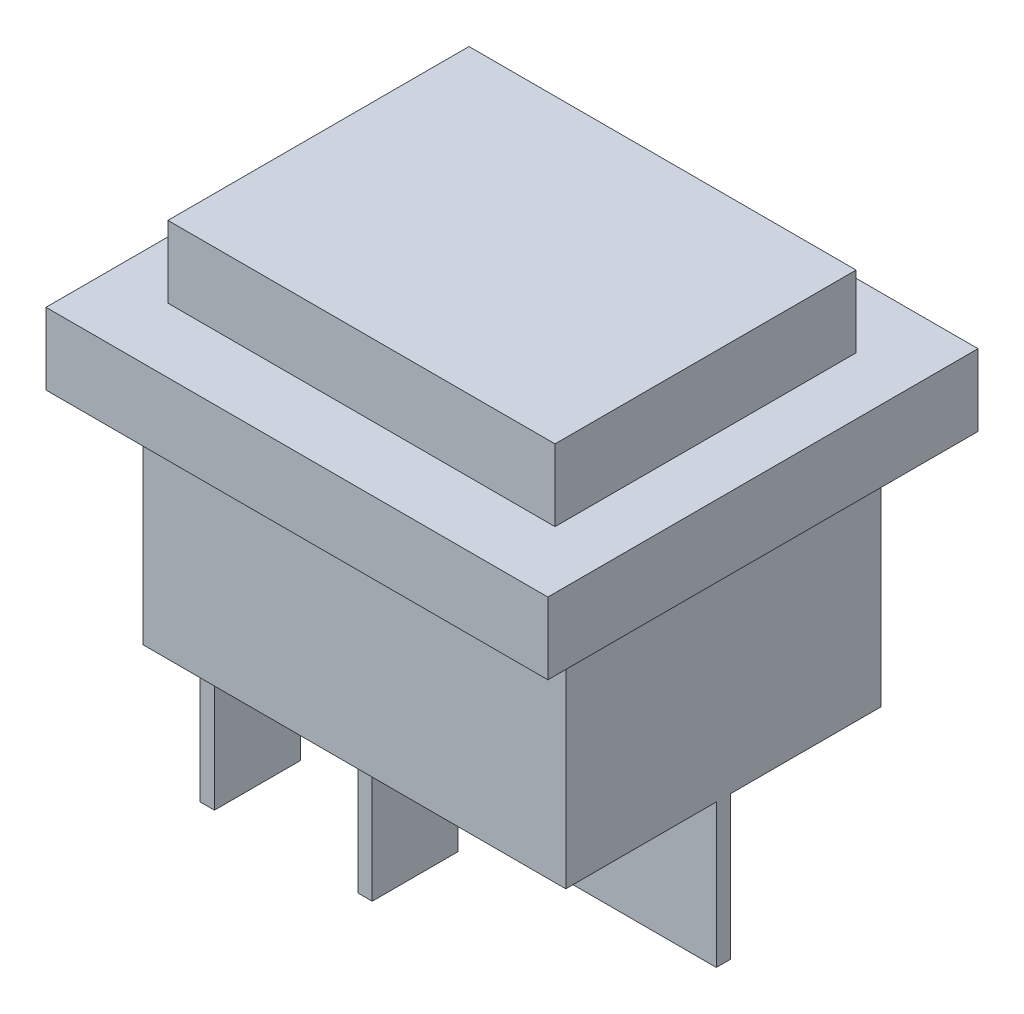
ISO-10303-21;
HEADER;
FILE_DESCRIPTION(('STEP AP214'),'2;1');
FILE_NAME('part.step','',(''),(''),'','','');
FILE_SCHEMA(('AUTOMOTIVE_DESIGN { 1 0 10303 214 1 1 1 1 }'));
ENDSEC;
DATA;
#1=APPLICATION_CONTEXT('core data for automotive mechanical design processes');
#2=APPLICATION_PROTOCOL_DEFINITION('international standard','automotive_design',2000,#1);
#3=PRODUCT_CONTEXT('',#1,'mechanical');
#4=PRODUCT('Part','Part','',(#3));
#5=PRODUCT_RELATED_PRODUCT_CATEGORY('part','',(#4));
#6=PRODUCT_DEFINITION_FORMATION('','',#4);
#7=PRODUCT_DEFINITION_CONTEXT('part definition',#1,'design');
#8=PRODUCT_DEFINITION('design','',#6,#7);
#9=PRODUCT_DEFINITION_SHAPE('','',#8);
#10=(LENGTH_UNIT() NAMED_UNIT(*) SI_UNIT(.MILLI.,.METRE.));
#11=(NAMED_UNIT(*) PLANE_ANGLE_UNIT() SI_UNIT($,.RADIAN.));
#12=(NAMED_UNIT(*) SI_UNIT($,.STERADIAN.) SOLID_ANGLE_UNIT());
#13=UNCERTAINTY_MEASURE_WITH_UNIT(LENGTH_MEASURE(1.E-05),#10,'distance_accuracy_value','');
#14=(GEOMETRIC_REPRESENTATION_CONTEXT(3) GLOBAL_UNCERTAINTY_ASSIGNED_CONTEXT((#13)) GLOBAL_UNIT_ASSIGNED_CONTEXT((#10,
#11,#12)) REPRESENTATION_CONTEXT('',''));
#15=CARTESIAN_POINT('',(0.,0.,0.));
#16=DIRECTION('',(0.,0.,1.));
#17=DIRECTION('',(1.,0.,0.));
#18=AXIS2_PLACEMENT_3D('',#15,#16,#17);
#19=CARTESIAN_POINT('',(0.,-16.,0.));
#20=DIRECTION('',(0.,1.,0.));
#21=DIRECTION('',(0.,0.,1.));
#22=AXIS2_PLACEMENT_3D('',#19,#20,#21);
#23=PLANE('',#22);
#24=DIRECTION('',(0.,0.,1.));
#25=VECTOR('',#24,1.);
#26=CARTESIAN_POINT('',(-12.25,-16.,-2.5));
#27=LINE('',#26,#25);
#28=CARTESIAN_POINT('',(-12.25,-16.,-8.5));
#29=VERTEX_POINT('',#28);
#30=CARTESIAN_POINT('',(-12.25,-16.,-2.5));
#31=VERTEX_POINT('',#30);
#32=EDGE_CURVE('E275',#29,#31,#27,.T.);
#33=ORIENTED_EDGE('',*,*,#32,.F.);
#34=DIRECTION('',(1.,0.,0.));
#35=VECTOR('',#34,1.);
#36=CARTESIAN_POINT('',(-13.25,-16.,-8.5));
#37=LINE('',#36,#35);
#38=CARTESIAN_POINT('',(-13.25,-16.,-8.5));
#39=VERTEX_POINT('',#38);
#40=EDGE_CURVE('E291',#39,#29,#37,.T.);
#41=ORIENTED_EDGE('',*,*,#40,.F.);
#42=DIRECTION('',(0.,0.,-1.));
#43=VECTOR('',#42,1.);
#44=CARTESIAN_POINT('',(-13.25,-16.,-2.5));
#45=LINE('',#44,#43);
#46=CARTESIAN_POINT('',(-13.25,-16.,-2.5));
#47=VERTEX_POINT('',#46);
#48=EDGE_CURVE('E304',#47,#39,#45,.T.);
#49=ORIENTED_EDGE('',*,*,#48,.F.);
#50=DIRECTION('',(-1.,0.,0.));
#51=VECTOR('',#50,1.);
#52=CARTESIAN_POINT('',(-13.25,-16.,-2.5));
#53=LINE('',#52,#51);
#54=EDGE_CURVE('E280',#31,#47,#53,.T.);
#55=ORIENTED_EDGE('',*,*,#54,.F.);
#56=EDGE_LOOP('',(#33,#41,#49,#55));
#57=FACE_BOUND('',#56,.T.);
#58=DIRECTION('',(1.,0.,0.));
#59=VECTOR('',#58,1.);
#60=CARTESIAN_POINT('',(-14.75,-16.,-0.5));
#61=LINE('',#60,#59);
#62=CARTESIAN_POINT('',(-14.75,-16.,-0.5));
#63=VERTEX_POINT('',#62);
#64=CARTESIAN_POINT('',(14.75,-16.,-0.5));
#65=VERTEX_POINT('',#64);
#66=EDGE_CURVE('E422',#63,#65,#61,.T.);
#67=ORIENTED_EDGE('',*,*,#66,.F.);
#68=DIRECTION('',(0.,0.,1.));
#69=VECTOR('',#68,1.);
#70=CARTESIAN_POINT('',(-14.75,-16.,-11.));
#71=LINE('',#70,#69);
#72=CARTESIAN_POINT('',(-14.75,-16.,-11.));
#73=VERTEX_POINT('',#72);
#74=EDGE_CURVE('E551',#73,#63,#71,.T.);
#75=ORIENTED_EDGE('',*,*,#74,.F.);
#76=DIRECTION('',(-1.,0.,0.));
#77=VECTOR('',#76,1.);
#78=CARTESIAN_POINT('',(-14.75,-16.,-11.));
#79=LINE('',#78,#77);
#80=CARTESIAN_POINT('',(14.75,-16.,-11.));
#81=VERTEX_POINT('',#80);
#82=EDGE_CURVE('E545',#81,#73,#79,.T.);
#83=ORIENTED_EDGE('',*,*,#82,.F.);
#84=DIRECTION('',(0.,0.,-1.));
#85=VECTOR('',#84,1.);
#86=CARTESIAN_POINT('',(14.75,-16.,-11.));
#87=LINE('',#86,#85);
#88=EDGE_CURVE('E546',#65,#81,#87,.T.);
#89=ORIENTED_EDGE('',*,*,#88,.F.);
#90=EDGE_LOOP('',(#67,#75,#83,#89));
#91=FACE_BOUND('',#90,.T.);
#92=DIRECTION('',(0.,0.,1.));
#93=VECTOR('',#92,1.);
#94=CARTESIAN_POINT('',(-1.25,-16.,-2.5));
#95=LINE('',#94,#93);
#96=CARTESIAN_POINT('',(-1.25,-16.,-8.5));
#97=VERTEX_POINT('',#96);
#98=CARTESIAN_POINT('',(-1.25,-16.,-2.5));
#99=VERTEX_POINT('',#98);
#100=EDGE_CURVE('E273',#97,#99,#95,.T.);
#101=ORIENTED_EDGE('',*,*,#100,.F.);
#102=DIRECTION('',(1.,0.,0.));
#103=VECTOR('',#102,1.);
#104=CARTESIAN_POINT('',(-2.25,-16.,-8.5));
#105=LINE('',#104,#103);
#106=CARTESIAN_POINT('',(-2.25,-16.,-8.5));
#107=VERTEX_POINT('',#106);
#108=EDGE_CURVE('E270',#107,#97,#105,.T.);
#109=ORIENTED_EDGE('',*,*,#108,.F.);
#110=DIRECTION('',(0.,0.,-1.));
#111=VECTOR('',#110,1.);
#112=CARTESIAN_POINT('',(-2.25,-16.,-2.5));
#113=LINE('',#112,#111);
#114=CARTESIAN_POINT('',(-2.25,-16.,-2.5));
#115=VERTEX_POINT('',#114);
#116=EDGE_CURVE('E62',#115,#107,#113,.T.);
#117=ORIENTED_EDGE('',*,*,#116,.F.);
#118=DIRECTION('',(-1.,0.,0.));
#119=VECTOR('',#118,1.);
#120=CARTESIAN_POINT('',(-2.25,-16.,-2.5));
#121=LINE('',#120,#119);
#122=EDGE_CURVE('E57',#99,#115,#121,.T.);
#123=ORIENTED_EDGE('',*,*,#122,.F.);
#124=EDGE_LOOP('',(#101,#109,#117,#123));
#125=FACE_BOUND('',#124,.T.);
#126=ADVANCED_FACE('F39',(#57,#91,#125),#23,.F.);
#127=DIRECTION('',(0.,0.,1.));
#128=VECTOR('',#127,1.);
#129=CARTESIAN_POINT('',(-12.25,-16.,8.5));
#130=LINE('',#129,#128);
#131=CARTESIAN_POINT('',(-12.25,-16.,2.5));
#132=VERTEX_POINT('',#131);
#133=CARTESIAN_POINT('',(-12.25,-16.,8.5));
#134=VERTEX_POINT('',#133);
#135=EDGE_CURVE('E371',#132,#134,#130,.T.);
#136=ORIENTED_EDGE('',*,*,#135,.F.);
#137=DIRECTION('',(1.,0.,0.));
#138=VECTOR('',#137,1.);
#139=CARTESIAN_POINT('',(-13.25,-16.,2.5));
#140=LINE('',#139,#138);
#141=CARTESIAN_POINT('',(-13.25,-16.,2.5));
#142=VERTEX_POINT('',#141);
#143=EDGE_CURVE('E377',#142,#132,#140,.T.);
#144=ORIENTED_EDGE('',*,*,#143,.F.);
#145=DIRECTION('',(0.,0.,-1.));
#146=VECTOR('',#145,1.);
#147=CARTESIAN_POINT('',(-13.25,-16.,8.5));
#148=LINE('',#147,#146);
#149=CARTESIAN_POINT('',(-13.25,-16.,8.5));
#150=VERTEX_POINT('',#149);
#151=EDGE_CURVE('E394',#150,#142,#148,.T.);
#152=ORIENTED_EDGE('',*,*,#151,.F.);
#153=DIRECTION('',(-1.,0.,0.));
#154=VECTOR('',#153,1.);
#155=CARTESIAN_POINT('',(-13.25,-16.,8.5));
#156=LINE('',#155,#154);
#157=EDGE_CURVE('E390',#134,#150,#156,.T.);
#158=ORIENTED_EDGE('',*,*,#157,.F.);
#159=EDGE_LOOP('',(#136,#144,#152,#158));
#160=FACE_BOUND('',#159,.T.);
#161=DIRECTION('',(-1.,0.,0.));
#162=VECTOR('',#161,1.);
#163=CARTESIAN_POINT('',(-14.75,-16.,0.5));
#164=LINE('',#163,#162);
#165=CARTESIAN_POINT('',(14.75,-16.,0.5));
#166=VERTEX_POINT('',#165);
#167=CARTESIAN_POINT('',(-14.75,-16.,0.5));
#168=VERTEX_POINT('',#167);
#169=EDGE_CURVE('E416',#166,#168,#164,.T.);
#170=ORIENTED_EDGE('',*,*,#169,.F.);
#171=CARTESIAN_POINT('',(14.75,-16.,11.));
#172=VERTEX_POINT('',#171);
#173=EDGE_CURVE('E541',#172,#166,#87,.T.);
#174=ORIENTED_EDGE('',*,*,#173,.F.);
#175=DIRECTION('',(1.,0.,0.));
#176=VECTOR('',#175,1.);
#177=CARTESIAN_POINT('',(-14.75,-16.,11.));
#178=LINE('',#177,#176);
#179=CARTESIAN_POINT('',(-14.75,-16.,11.));
#180=VERTEX_POINT('',#179);
#181=EDGE_CURVE('E555',#180,#172,#178,.T.);
#182=ORIENTED_EDGE('',*,*,#181,.F.);
#183=EDGE_CURVE('E550',#168,#180,#71,.T.);
#184=ORIENTED_EDGE('',*,*,#183,.F.);
#185=EDGE_LOOP('',(#170,#174,#182,#184));
#186=FACE_BOUND('',#185,.T.);
#187=DIRECTION('',(0.,0.,1.));
#188=VECTOR('',#187,1.);
#189=CARTESIAN_POINT('',(-1.25,-16.,8.5));
#190=LINE('',#189,#188);
#191=CARTESIAN_POINT('',(-1.25,-16.,2.5));
#192=VERTEX_POINT('',#191);
#193=CARTESIAN_POINT('',(-1.25,-16.,8.5));
#194=VERTEX_POINT('',#193);
#195=EDGE_CURVE('E326',#192,#194,#190,.T.);
#196=ORIENTED_EDGE('',*,*,#195,.F.);
#197=DIRECTION('',(1.,0.,0.));
#198=VECTOR('',#197,1.);
#199=CARTESIAN_POINT('',(-2.25,-16.,2.5));
#200=LINE('',#199,#198);
#201=CARTESIAN_POINT('',(-2.25,-16.,2.5));
#202=VERTEX_POINT('',#201);
#203=EDGE_CURVE('E332',#202,#192,#200,.T.);
#204=ORIENTED_EDGE('',*,*,#203,.F.);
#205=DIRECTION('',(0.,0.,-1.));
#206=VECTOR('',#205,1.);
#207=CARTESIAN_POINT('',(-2.25,-16.,8.5));
#208=LINE('',#207,#206);
#209=CARTESIAN_POINT('',(-2.25,-16.,8.5));
#210=VERTEX_POINT('',#209);
#211=EDGE_CURVE('E349',#210,#202,#208,.T.);
#212=ORIENTED_EDGE('',*,*,#211,.F.);
#213=DIRECTION('',(-1.,0.,0.));
#214=VECTOR('',#213,1.);
#215=CARTESIAN_POINT('',(-2.25,-16.,8.5));
#216=LINE('',#215,#214);
#217=EDGE_CURVE('E345',#194,#210,#216,.T.);
#218=ORIENTED_EDGE('',*,*,#217,.F.);
#219=EDGE_LOOP('',(#196,#204,#212,#218));
#220=FACE_BOUND('',#219,.T.);
#221=ADVANCED_FACE('F595',(#160,#186,#220),#23,.F.);
#222=CARTESIAN_POINT('',(14.75,-16.,-11.));
#223=DIRECTION('',(1.,0.,0.));
#224=DIRECTION('',(0.,0.,-1.));
#225=AXIS2_PLACEMENT_3D('',#222,#223,#224);
#226=PLANE('',#225);
#227=DIRECTION('',(0.,0.,-1.));
#228=VECTOR('',#227,1.);
#229=CARTESIAN_POINT('',(14.75,0.,-11.));
#230=LINE('',#229,#228);
#231=CARTESIAN_POINT('',(14.75,0.,11.));
#232=VERTEX_POINT('',#231);
#233=CARTESIAN_POINT('',(14.75,0.,-11.));
#234=VERTEX_POINT('',#233);
#235=EDGE_CURVE('E540',#232,#234,#230,.T.);
#236=ORIENTED_EDGE('',*,*,#235,.F.);
#237=DIRECTION('',(0.,1.,0.));
#238=VECTOR('',#237,1.);
#239=CARTESIAN_POINT('',(14.75,-16.,11.));
#240=LINE('',#239,#238);
#241=EDGE_CURVE('E11',#172,#232,#240,.T.);
#242=ORIENTED_EDGE('',*,*,#241,.F.);
#243=ORIENTED_EDGE('',*,*,#173,.T.);
#244=DIRECTION('',(0.,1.,0.));
#245=VECTOR('',#244,1.);
#246=CARTESIAN_POINT('',(14.75,-26.,0.5));
#247=LINE('',#246,#245);
#248=CARTESIAN_POINT('',(14.75,-26.,0.5));
#249=VERTEX_POINT('',#248);
#250=EDGE_CURVE('E449',#249,#166,#247,.T.);
#251=ORIENTED_EDGE('',*,*,#250,.F.);
#252=DIRECTION('',(0.,0.,1.));
#253=VECTOR('',#252,1.);
#254=CARTESIAN_POINT('',(14.75,-26.,0.5));
#255=LINE('',#254,#253);
#256=CARTESIAN_POINT('',(14.75,-26.,-0.5));
#257=VERTEX_POINT('',#256);
#258=EDGE_CURVE('E417',#257,#249,#255,.T.);
#259=ORIENTED_EDGE('',*,*,#258,.F.);
#260=DIRECTION('',(0.,1.,0.));
#261=VECTOR('',#260,1.);
#262=CARTESIAN_POINT('',(14.75,-26.,-0.5));
#263=LINE('',#262,#261);
#264=EDGE_CURVE('E431',#257,#65,#263,.T.);
#265=ORIENTED_EDGE('',*,*,#264,.T.);
#266=ORIENTED_EDGE('',*,*,#88,.T.);
#267=DIRECTION('',(0.,1.,0.));
#268=VECTOR('',#267,1.);
#269=CARTESIAN_POINT('',(14.75,-16.,-11.));
#270=LINE('',#269,#268);
#271=EDGE_CURVE('E43',#81,#234,#270,.T.);
#272=ORIENTED_EDGE('',*,*,#271,.T.);
#273=EDGE_LOOP('',(#236,#242,#243,#251,#259,#265,#266,#272));
#274=FACE_BOUND('',#273,.T.);
#275=ADVANCED_FACE('F41',(#274),#226,.T.);
#276=CARTESIAN_POINT('',(-14.75,-16.,11.));
#277=DIRECTION('',(0.,0.,1.));
#278=DIRECTION('',(1.,0.,0.));
#279=AXIS2_PLACEMENT_3D('',#276,#277,#278);
#280=PLANE('',#279);
#281=DIRECTION('',(1.,0.,0.));
#282=VECTOR('',#281,1.);
#283=CARTESIAN_POINT('',(-14.75,0.,11.));
#284=LINE('',#283,#282);
#285=CARTESIAN_POINT('',(-14.75,0.,11.));
#286=VERTEX_POINT('',#285);
#287=EDGE_CURVE('E570',#286,#232,#284,.T.);
#288=ORIENTED_EDGE('',*,*,#287,.F.);
#289=DIRECTION('',(0.,1.,0.));
#290=VECTOR('',#289,1.);
#291=CARTESIAN_POINT('',(-14.75,-16.,11.));
#292=LINE('',#291,#290);
#293=EDGE_CURVE('E49',#180,#286,#292,.T.);
#294=ORIENTED_EDGE('',*,*,#293,.F.);
#295=ORIENTED_EDGE('',*,*,#181,.T.);
#296=ORIENTED_EDGE('',*,*,#241,.T.);
#297=EDGE_LOOP('',(#288,#294,#295,#296));
#298=FACE_BOUND('',#297,.T.);
#299=ADVANCED_FACE('F590',(#298),#280,.T.);
#300=CARTESIAN_POINT('',(-14.75,-16.,-11.));
#301=DIRECTION('',(-1.,0.,0.));
#302=DIRECTION('',(0.,0.,1.));
#303=AXIS2_PLACEMENT_3D('',#300,#301,#302);
#304=PLANE('',#303);
#305=DIRECTION('',(0.,0.,1.));
#306=VECTOR('',#305,1.);
#307=CARTESIAN_POINT('',(-14.75,0.,-11.));
#308=LINE('',#307,#306);
#309=CARTESIAN_POINT('',(-14.75,0.,-11.));
#310=VERTEX_POINT('',#309);
#311=EDGE_CURVE('E566',#310,#286,#308,.T.);
#312=ORIENTED_EDGE('',*,*,#311,.F.);
#313=DIRECTION('',(0.,1.,0.));
#314=VECTOR('',#313,1.);
#315=CARTESIAN_POINT('',(-14.75,-16.,-11.));
#316=LINE('',#315,#314);
#317=EDGE_CURVE('E575',#73,#310,#316,.T.);
#318=ORIENTED_EDGE('',*,*,#317,.F.);
#319=ORIENTED_EDGE('',*,*,#74,.T.);
#320=DIRECTION('',(0.,1.,0.));
#321=VECTOR('',#320,1.);
#322=CARTESIAN_POINT('',(-14.75,-26.,-0.5));
#323=LINE('',#322,#321);
#324=CARTESIAN_POINT('',(-14.75,-26.,-0.5));
#325=VERTEX_POINT('',#324);
#326=EDGE_CURVE('E441',#325,#63,#323,.T.);
#327=ORIENTED_EDGE('',*,*,#326,.F.);
#328=DIRECTION('',(0.,0.,-1.));
#329=VECTOR('',#328,1.);
#330=CARTESIAN_POINT('',(-14.75,-26.,0.5));
#331=LINE('',#330,#329);
#332=CARTESIAN_POINT('',(-14.75,-26.,0.5));
#333=VERTEX_POINT('',#332);
#334=EDGE_CURVE('E425',#333,#325,#331,.T.);
#335=ORIENTED_EDGE('',*,*,#334,.F.);
#336=DIRECTION('',(0.,1.,0.));
#337=VECTOR('',#336,1.);
#338=CARTESIAN_POINT('',(-14.75,-26.,0.5));
#339=LINE('',#338,#337);
#340=EDGE_CURVE('E445',#333,#168,#339,.T.);
#341=ORIENTED_EDGE('',*,*,#340,.T.);
#342=ORIENTED_EDGE('',*,*,#183,.T.);
#343=ORIENTED_EDGE('',*,*,#293,.T.);
#344=EDGE_LOOP('',(#312,#318,#319,#327,#335,#341,#342,#343));
#345=FACE_BOUND('',#344,.T.);
#346=ADVANCED_FACE('F602',(#345),#304,.T.);
#347=CARTESIAN_POINT('',(-14.75,-16.,-11.));
#348=DIRECTION('',(0.,0.,-1.));
#349=DIRECTION('',(-1.,0.,0.));
#350=AXIS2_PLACEMENT_3D('',#347,#348,#349);
#351=PLANE('',#350);
#352=DIRECTION('',(-1.,0.,0.));
#353=VECTOR('',#352,1.);
#354=CARTESIAN_POINT('',(-14.75,0.,-11.));
#355=LINE('',#354,#353);
#356=EDGE_CURVE('E562',#234,#310,#355,.T.);
#357=ORIENTED_EDGE('',*,*,#356,.F.);
#358=ORIENTED_EDGE('',*,*,#271,.F.);
#359=ORIENTED_EDGE('',*,*,#82,.T.);
#360=ORIENTED_EDGE('',*,*,#317,.T.);
#361=EDGE_LOOP('',(#357,#358,#359,#360));
#362=FACE_BOUND('',#361,.T.);
#363=ADVANCED_FACE('F584',(#362),#351,.T.);
#364=CARTESIAN_POINT('',(0.,0.,0.));
#365=DIRECTION('',(0.,1.,0.));
#366=DIRECTION('',(0.,0.,1.));
#367=AXIS2_PLACEMENT_3D('',#364,#365,#366);
#368=PLANE('',#367);
#369=DIRECTION('',(0.,0.,-1.));
#370=VECTOR('',#369,1.);
#371=CARTESIAN_POINT('',(17.5,0.,-15.));
#372=LINE('',#371,#370);
#373=CARTESIAN_POINT('',(17.5,0.,15.));
#374=VERTEX_POINT('',#373);
#375=CARTESIAN_POINT('',(17.5,0.,-15.));
#376=VERTEX_POINT('',#375);
#377=EDGE_CURVE('E498',#374,#376,#372,.T.);
#378=ORIENTED_EDGE('',*,*,#377,.F.);
#379=DIRECTION('',(1.,0.,0.));
#380=VECTOR('',#379,1.);
#381=CARTESIAN_POINT('',(-17.5,0.,15.));
#382=LINE('',#381,#380);
#383=CARTESIAN_POINT('',(-17.5,0.,15.));
#384=VERTEX_POINT('',#383);
#385=EDGE_CURVE('E504',#384,#374,#382,.T.);
#386=ORIENTED_EDGE('',*,*,#385,.F.);
#387=DIRECTION('',(0.,0.,1.));
#388=VECTOR('',#387,1.);
#389=CARTESIAN_POINT('',(-17.5,0.,-15.));
#390=LINE('',#389,#388);
#391=CARTESIAN_POINT('',(-17.5,0.,-15.));
#392=VERTEX_POINT('',#391);
#393=EDGE_CURVE('E520',#392,#384,#390,.T.);
#394=ORIENTED_EDGE('',*,*,#393,.F.);
#395=DIRECTION('',(-1.,0.,0.));
#396=VECTOR('',#395,1.);
#397=CARTESIAN_POINT('',(-17.5,0.,-15.));
#398=LINE('',#397,#396);
#399=EDGE_CURVE('E517',#376,#392,#398,.T.);
#400=ORIENTED_EDGE('',*,*,#399,.F.);
#401=EDGE_LOOP('',(#378,#386,#394,#400));
#402=FACE_BOUND('',#401,.T.);
#403=ORIENTED_EDGE('',*,*,#287,.T.);
#404=ORIENTED_EDGE('',*,*,#235,.T.);
#405=ORIENTED_EDGE('',*,*,#356,.T.);
#406=ORIENTED_EDGE('',*,*,#311,.T.);
#407=EDGE_LOOP('',(#403,#404,#405,#406));
#408=FACE_BOUND('',#407,.T.);
#409=ADVANCED_FACE('F586',(#402,#408),#368,.F.);
#410=CARTESIAN_POINT('',(17.5,5.,-15.));
#411=DIRECTION('',(-1.,0.,0.));
#412=DIRECTION('',(0.,0.,1.));
#413=AXIS2_PLACEMENT_3D('',#410,#411,#412);
#414=PLANE('',#413);
#415=ORIENTED_EDGE('',*,*,#377,.T.);
#416=DIRECTION('',(0.,-1.,0.));
#417=VECTOR('',#416,1.);
#418=CARTESIAN_POINT('',(17.5,5.,-15.));
#419=LINE('',#418,#417);
#420=CARTESIAN_POINT('',(17.5,5.,-15.));
#421=VERTEX_POINT('',#420);
#422=EDGE_CURVE('E536',#421,#376,#419,.T.);
#423=ORIENTED_EDGE('',*,*,#422,.F.);
#424=DIRECTION('',(0.,0.,-1.));
#425=VECTOR('',#424,1.);
#426=CARTESIAN_POINT('',(17.5,5.,-15.));
#427=LINE('',#426,#425);
#428=CARTESIAN_POINT('',(17.5,5.,15.));
#429=VERTEX_POINT('',#428);
#430=EDGE_CURVE('E499',#429,#421,#427,.T.);
#431=ORIENTED_EDGE('',*,*,#430,.F.);
#432=DIRECTION('',(0.,-1.,0.));
#433=VECTOR('',#432,1.);
#434=CARTESIAN_POINT('',(17.5,5.,15.));
#435=LINE('',#434,#433);
#436=EDGE_CURVE('E513',#429,#374,#435,.T.);
#437=ORIENTED_EDGE('',*,*,#436,.T.);
#438=EDGE_LOOP('',(#415,#423,#431,#437));
#439=FACE_BOUND('',#438,.T.);
#440=ADVANCED_FACE('F746',(#439),#414,.F.);
#441=CARTESIAN_POINT('',(-17.5,5.,-15.));
#442=DIRECTION('',(0.,0.,1.));
#443=DIRECTION('',(1.,0.,0.));
#444=AXIS2_PLACEMENT_3D('',#441,#442,#443);
#445=PLANE('',#444);
#446=ORIENTED_EDGE('',*,*,#399,.T.);
#447=DIRECTION('',(0.,-1.,0.));
#448=VECTOR('',#447,1.);
#449=CARTESIAN_POINT('',(-17.5,5.,-15.));
#450=LINE('',#449,#448);
#451=CARTESIAN_POINT('',(-17.5,5.,-15.));
#452=VERTEX_POINT('',#451);
#453=EDGE_CURVE('E532',#452,#392,#450,.T.);
#454=ORIENTED_EDGE('',*,*,#453,.F.);
#455=DIRECTION('',(-1.,0.,0.));
#456=VECTOR('',#455,1.);
#457=CARTESIAN_POINT('',(-17.5,5.,-15.));
#458=LINE('',#457,#456);
#459=EDGE_CURVE('E503',#421,#452,#458,.T.);
#460=ORIENTED_EDGE('',*,*,#459,.F.);
#461=ORIENTED_EDGE('',*,*,#422,.T.);
#462=EDGE_LOOP('',(#446,#454,#460,#461));
#463=FACE_BOUND('',#462,.T.);
#464=ADVANCED_FACE('F754',(#463),#445,.F.);
#465=CARTESIAN_POINT('',(-17.5,5.,-15.));
#466=DIRECTION('',(1.,0.,0.));
#467=DIRECTION('',(0.,0.,-1.));
#468=AXIS2_PLACEMENT_3D('',#465,#466,#467);
#469=PLANE('',#468);
#470=ORIENTED_EDGE('',*,*,#393,.T.);
#471=DIRECTION('',(0.,-1.,0.));
#472=VECTOR('',#471,1.);
#473=CARTESIAN_POINT('',(-17.5,5.,15.));
#474=LINE('',#473,#472);
#475=CARTESIAN_POINT('',(-17.5,5.,15.));
#476=VERTEX_POINT('',#475);
#477=EDGE_CURVE('E528',#476,#384,#474,.T.);
#478=ORIENTED_EDGE('',*,*,#477,.F.);
#479=DIRECTION('',(0.,0.,1.));
#480=VECTOR('',#479,1.);
#481=CARTESIAN_POINT('',(-17.5,5.,-15.));
#482=LINE('',#481,#480);
#483=EDGE_CURVE('E507',#452,#476,#482,.T.);
#484=ORIENTED_EDGE('',*,*,#483,.F.);
#485=ORIENTED_EDGE('',*,*,#453,.T.);
#486=EDGE_LOOP('',(#470,#478,#484,#485));
#487=FACE_BOUND('',#486,.T.);
#488=ADVANCED_FACE('F750',(#487),#469,.F.);
#489=CARTESIAN_POINT('',(-17.5,5.,15.));
#490=DIRECTION('',(0.,0.,-1.));
#491=DIRECTION('',(-1.,0.,0.));
#492=AXIS2_PLACEMENT_3D('',#489,#490,#491);
#493=PLANE('',#492);
#494=ORIENTED_EDGE('',*,*,#385,.T.);
#495=ORIENTED_EDGE('',*,*,#436,.F.);
#496=DIRECTION('',(1.,0.,0.));
#497=VECTOR('',#496,1.);
#498=CARTESIAN_POINT('',(-17.5,5.,15.));
#499=LINE('',#498,#497);
#500=EDGE_CURVE('E510',#476,#429,#499,.T.);
#501=ORIENTED_EDGE('',*,*,#500,.F.);
#502=ORIENTED_EDGE('',*,*,#477,.T.);
#503=EDGE_LOOP('',(#494,#495,#501,#502));
#504=FACE_BOUND('',#503,.T.);
#505=ADVANCED_FACE('F742',(#504),#493,.F.);
#506=CARTESIAN_POINT('',(0.,5.,0.));
#507=DIRECTION('',(0.,1.,0.));
#508=DIRECTION('',(0.,0.,1.));
#509=AXIS2_PLACEMENT_3D('',#506,#507,#508);
#510=PLANE('',#509);
#511=DIRECTION('',(0.,0.,-1.));
#512=VECTOR('',#511,1.);
#513=CARTESIAN_POINT('',(13.5,5.,-10.5));
#514=LINE('',#513,#512);
#515=CARTESIAN_POINT('',(13.5,5.,10.5));
#516=VERTEX_POINT('',#515);
#517=CARTESIAN_POINT('',(13.5,5.,-10.5));
#518=VERTEX_POINT('',#517);
#519=EDGE_CURVE('E453',#516,#518,#514,.T.);
#520=ORIENTED_EDGE('',*,*,#519,.F.);
#521=DIRECTION('',(1.,0.,0.));
#522=VECTOR('',#521,1.);
#523=CARTESIAN_POINT('',(-13.5,5.,10.5));
#524=LINE('',#523,#522);
#525=CARTESIAN_POINT('',(-13.5,5.,10.5));
#526=VERTEX_POINT('',#525);
#527=EDGE_CURVE('E459',#526,#516,#524,.T.);
#528=ORIENTED_EDGE('',*,*,#527,.F.);
#529=DIRECTION('',(0.,0.,1.));
#530=VECTOR('',#529,1.);
#531=CARTESIAN_POINT('',(-13.5,5.,-10.5));
#532=LINE('',#531,#530);
#533=CARTESIAN_POINT('',(-13.5,5.,-10.5));
#534=VERTEX_POINT('',#533);
#535=EDGE_CURVE('E476',#534,#526,#532,.T.);
#536=ORIENTED_EDGE('',*,*,#535,.F.);
#537=DIRECTION('',(-1.,0.,0.));
#538=VECTOR('',#537,1.);
#539=CARTESIAN_POINT('',(-13.5,5.,-10.5));
#540=LINE('',#539,#538);
#541=EDGE_CURVE('E472',#518,#534,#540,.T.);
#542=ORIENTED_EDGE('',*,*,#541,.F.);
#543=EDGE_LOOP('',(#520,#528,#536,#542));
#544=FACE_BOUND('',#543,.T.);
#545=ORIENTED_EDGE('',*,*,#430,.T.);
#546=ORIENTED_EDGE('',*,*,#459,.T.);
#547=ORIENTED_EDGE('',*,*,#483,.T.);
#548=ORIENTED_EDGE('',*,*,#500,.T.);
#549=EDGE_LOOP('',(#545,#546,#547,#548));
#550=FACE_BOUND('',#549,.T.);
#551=ADVANCED_FACE('F738',(#544,#550),#510,.T.);
#552=CARTESIAN_POINT('',(13.5,10.,-10.5));
#553=DIRECTION('',(-1.,0.,0.));
#554=DIRECTION('',(0.,0.,1.));
#555=AXIS2_PLACEMENT_3D('',#552,#553,#554);
#556=PLANE('',#555);
#557=ORIENTED_EDGE('',*,*,#519,.T.);
#558=DIRECTION('',(0.,-1.,0.));
#559=VECTOR('',#558,1.);
#560=CARTESIAN_POINT('',(13.5,10.,-10.5));
#561=LINE('',#560,#559);
#562=CARTESIAN_POINT('',(13.5,10.,-10.5));
#563=VERTEX_POINT('',#562);
#564=EDGE_CURVE('E494',#563,#518,#561,.T.);
#565=ORIENTED_EDGE('',*,*,#564,.F.);
#566=DIRECTION('',(0.,0.,-1.));
#567=VECTOR('',#566,1.);
#568=CARTESIAN_POINT('',(13.5,10.,-10.5));
#569=LINE('',#568,#567);
#570=CARTESIAN_POINT('',(13.5,10.,10.5));
#571=VERTEX_POINT('',#570);
#572=EDGE_CURVE('E454',#571,#563,#569,.T.);
#573=ORIENTED_EDGE('',*,*,#572,.F.);
#574=DIRECTION('',(0.,-1.,0.));
#575=VECTOR('',#574,1.);
#576=CARTESIAN_POINT('',(13.5,10.,10.5));
#577=LINE('',#576,#575);
#578=EDGE_CURVE('E468',#571,#516,#577,.T.);
#579=ORIENTED_EDGE('',*,*,#578,.T.);
#580=EDGE_LOOP('',(#557,#565,#573,#579));
#581=FACE_BOUND('',#580,.T.);
#582=ADVANCED_FACE('F734',(#581),#556,.F.);
#583=CARTESIAN_POINT('',(-13.5,10.,-10.5));
#584=DIRECTION('',(0.,0.,1.));
#585=DIRECTION('',(1.,0.,0.));
#586=AXIS2_PLACEMENT_3D('',#583,#584,#585);
#587=PLANE('',#586);
#588=ORIENTED_EDGE('',*,*,#541,.T.);
#589=DIRECTION('',(0.,-1.,0.));
#590=VECTOR('',#589,1.);
#591=CARTESIAN_POINT('',(-13.5,10.,-10.5));
#592=LINE('',#591,#590);
#593=CARTESIAN_POINT('',(-13.5,10.,-10.5));
#594=VERTEX_POINT('',#593);
#595=EDGE_CURVE('E490',#594,#534,#592,.T.);
#596=ORIENTED_EDGE('',*,*,#595,.F.);
#597=DIRECTION('',(-1.,0.,0.));
#598=VECTOR('',#597,1.);
#599=CARTESIAN_POINT('',(-13.5,10.,-10.5));
#600=LINE('',#599,#598);
#601=EDGE_CURVE('E458',#563,#594,#600,.T.);
#602=ORIENTED_EDGE('',*,*,#601,.F.);
#603=ORIENTED_EDGE('',*,*,#564,.T.);
#604=EDGE_LOOP('',(#588,#596,#602,#603));
#605=FACE_BOUND('',#604,.T.);
#606=ADVANCED_FACE('F730',(#605),#587,.F.);
#607=CARTESIAN_POINT('',(-13.5,10.,-10.5));
#608=DIRECTION('',(1.,0.,0.));
#609=DIRECTION('',(0.,0.,-1.));
#610=AXIS2_PLACEMENT_3D('',#607,#608,#609);
#611=PLANE('',#610);
#612=ORIENTED_EDGE('',*,*,#535,.T.);
#613=DIRECTION('',(0.,-1.,0.));
#614=VECTOR('',#613,1.);
#615=CARTESIAN_POINT('',(-13.5,10.,10.5));
#616=LINE('',#615,#614);
#617=CARTESIAN_POINT('',(-13.5,10.,10.5));
#618=VERTEX_POINT('',#617);
#619=EDGE_CURVE('E486',#618,#526,#616,.T.);
#620=ORIENTED_EDGE('',*,*,#619,.F.);
#621=DIRECTION('',(0.,0.,1.));
#622=VECTOR('',#621,1.);
#623=CARTESIAN_POINT('',(-13.5,10.,-10.5));
#624=LINE('',#623,#622);
#625=EDGE_CURVE('E462',#594,#618,#624,.T.);
#626=ORIENTED_EDGE('',*,*,#625,.F.);
#627=ORIENTED_EDGE('',*,*,#595,.T.);
#628=EDGE_LOOP('',(#612,#620,#626,#627));
#629=FACE_BOUND('',#628,.T.);
#630=ADVANCED_FACE('F726',(#629),#611,.F.);
#631=CARTESIAN_POINT('',(-13.5,10.,10.5));
#632=DIRECTION('',(0.,0.,-1.));
#633=DIRECTION('',(-1.,0.,0.));
#634=AXIS2_PLACEMENT_3D('',#631,#632,#633);
#635=PLANE('',#634);
#636=ORIENTED_EDGE('',*,*,#527,.T.);
#637=ORIENTED_EDGE('',*,*,#578,.F.);
#638=DIRECTION('',(1.,0.,0.));
#639=VECTOR('',#638,1.);
#640=CARTESIAN_POINT('',(-13.5,10.,10.5));
#641=LINE('',#640,#639);
#642=EDGE_CURVE('E465',#618,#571,#641,.T.);
#643=ORIENTED_EDGE('',*,*,#642,.F.);
#644=ORIENTED_EDGE('',*,*,#619,.T.);
#645=EDGE_LOOP('',(#636,#637,#643,#644));
#646=FACE_BOUND('',#645,.T.);
#647=ADVANCED_FACE('F722',(#646),#635,.F.);
#648=CARTESIAN_POINT('',(0.,10.,0.));
#649=DIRECTION('',(0.,1.,0.));
#650=DIRECTION('',(0.,0.,1.));
#651=AXIS2_PLACEMENT_3D('',#648,#649,#650);
#652=PLANE('',#651);
#653=ORIENTED_EDGE('',*,*,#572,.T.);
#654=ORIENTED_EDGE('',*,*,#601,.T.);
#655=ORIENTED_EDGE('',*,*,#625,.T.);
#656=ORIENTED_EDGE('',*,*,#642,.T.);
#657=EDGE_LOOP('',(#653,#654,#655,#656));
#658=FACE_BOUND('',#657,.T.);
#659=ADVANCED_FACE('F719',(#658),#652,.T.);
#660=CARTESIAN_POINT('',(-14.75,-26.,0.5));
#661=DIRECTION('',(0.,0.,-1.));
#662=DIRECTION('',(-1.,0.,0.));
#663=AXIS2_PLACEMENT_3D('',#660,#661,#662);
#664=PLANE('',#663);
#665=ORIENTED_EDGE('',*,*,#169,.T.);
#666=ORIENTED_EDGE('',*,*,#340,.F.);
#667=DIRECTION('',(-1.,0.,0.));
#668=VECTOR('',#667,1.);
#669=CARTESIAN_POINT('',(-14.75,-26.,0.5));
#670=LINE('',#669,#668);
#671=EDGE_CURVE('E421',#249,#333,#670,.T.);
#672=ORIENTED_EDGE('',*,*,#671,.F.);
#673=ORIENTED_EDGE('',*,*,#250,.T.);
#674=EDGE_LOOP('',(#665,#666,#672,#673));
#675=FACE_BOUND('',#674,.T.);
#676=ADVANCED_FACE('F599',(#675),#664,.F.);
#677=CARTESIAN_POINT('',(-14.75,-26.,-0.5));
#678=DIRECTION('',(0.,0.,1.));
#679=DIRECTION('',(1.,0.,0.));
#680=AXIS2_PLACEMENT_3D('',#677,#678,#679);
#681=PLANE('',#680);
#682=ORIENTED_EDGE('',*,*,#66,.T.);
#683=ORIENTED_EDGE('',*,*,#264,.F.);
#684=DIRECTION('',(1.,0.,0.));
#685=VECTOR('',#684,1.);
#686=CARTESIAN_POINT('',(-14.75,-26.,-0.5));
#687=LINE('',#686,#685);
#688=EDGE_CURVE('E428',#325,#257,#687,.T.);
#689=ORIENTED_EDGE('',*,*,#688,.F.);
#690=ORIENTED_EDGE('',*,*,#326,.T.);
#691=EDGE_LOOP('',(#682,#683,#689,#690));
#692=FACE_BOUND('',#691,.T.);
#693=ADVANCED_FACE('F610',(#692),#681,.F.);
#694=CARTESIAN_POINT('',(0.,-26.,0.));
#695=DIRECTION('',(0.,-1.,0.));
#696=DIRECTION('',(0.,0.,-1.));
#697=AXIS2_PLACEMENT_3D('',#694,#695,#696);
#698=PLANE('',#697);
#699=ORIENTED_EDGE('',*,*,#258,.T.);
#700=ORIENTED_EDGE('',*,*,#671,.T.);
#701=ORIENTED_EDGE('',*,*,#334,.T.);
#702=ORIENTED_EDGE('',*,*,#688,.T.);
#703=EDGE_LOOP('',(#699,#700,#701,#702));
#704=FACE_BOUND('',#703,.T.);
#705=ADVANCED_FACE('F606',(#704),#698,.T.);
#706=CARTESIAN_POINT('',(-12.25,-26.,8.5));
#707=DIRECTION('',(-1.,0.,0.));
#708=DIRECTION('',(0.,0.,1.));
#709=AXIS2_PLACEMENT_3D('',#706,#707,#708);
#710=PLANE('',#709);
#711=ORIENTED_EDGE('',*,*,#135,.T.);
#712=DIRECTION('',(0.,1.,0.));
#713=VECTOR('',#712,1.);
#714=CARTESIAN_POINT('',(-12.25,-26.,8.5));
#715=LINE('',#714,#713);
#716=CARTESIAN_POINT('',(-12.25,-26.,8.5));
#717=VERTEX_POINT('',#716);
#718=EDGE_CURVE('E412',#717,#134,#715,.T.);
#719=ORIENTED_EDGE('',*,*,#718,.F.);
#720=DIRECTION('',(0.,0.,1.));
#721=VECTOR('',#720,1.);
#722=CARTESIAN_POINT('',(-12.25,-26.,8.5));
#723=LINE('',#722,#721);
#724=CARTESIAN_POINT('',(-12.25,-26.,2.5));
#725=VERTEX_POINT('',#724);
#726=EDGE_CURVE('E372',#725,#717,#723,.T.);
#727=ORIENTED_EDGE('',*,*,#726,.F.);
#728=DIRECTION('',(0.,1.,0.));
#729=VECTOR('',#728,1.);
#730=CARTESIAN_POINT('',(-12.25,-26.,2.5));
#731=LINE('',#730,#729);
#732=EDGE_CURVE('E386',#725,#132,#731,.T.);
#733=ORIENTED_EDGE('',*,*,#732,.T.);
#734=EDGE_LOOP('',(#711,#719,#727,#733));
#735=FACE_BOUND('',#734,.T.);
#736=ADVANCED_FACE('F708',(#735),#710,.F.);
#737=CARTESIAN_POINT('',(-13.25,-26.,8.5));
#738=DIRECTION('',(0.,0.,-1.));
#739=DIRECTION('',(-1.,0.,0.));
#740=AXIS2_PLACEMENT_3D('',#737,#738,#739);
#741=PLANE('',#740);
#742=ORIENTED_EDGE('',*,*,#157,.T.);
#743=DIRECTION('',(0.,1.,0.));
#744=VECTOR('',#743,1.);
#745=CARTESIAN_POINT('',(-13.25,-26.,8.5));
#746=LINE('',#745,#744);
#747=CARTESIAN_POINT('',(-13.25,-26.,8.5));
#748=VERTEX_POINT('',#747);
#749=EDGE_CURVE('E408',#748,#150,#746,.T.);
#750=ORIENTED_EDGE('',*,*,#749,.F.);
#751=DIRECTION('',(-1.,0.,0.));
#752=VECTOR('',#751,1.);
#753=CARTESIAN_POINT('',(-13.25,-26.,8.5));
#754=LINE('',#753,#752);
#755=EDGE_CURVE('E376',#717,#748,#754,.T.);
#756=ORIENTED_EDGE('',*,*,#755,.F.);
#757=ORIENTED_EDGE('',*,*,#718,.T.);
#758=EDGE_LOOP('',(#742,#750,#756,#757));
#759=FACE_BOUND('',#758,.T.);
#760=ADVANCED_FACE('F704',(#759),#741,.F.);
#761=CARTESIAN_POINT('',(-13.25,-26.,8.5));
#762=DIRECTION('',(1.,0.,0.));
#763=DIRECTION('',(0.,0.,-1.));
#764=AXIS2_PLACEMENT_3D('',#761,#762,#763);
#765=PLANE('',#764);
#766=ORIENTED_EDGE('',*,*,#151,.T.);
#767=DIRECTION('',(0.,1.,0.));
#768=VECTOR('',#767,1.);
#769=CARTESIAN_POINT('',(-13.25,-26.,2.5));
#770=LINE('',#769,#768);
#771=CARTESIAN_POINT('',(-13.25,-26.,2.5));
#772=VERTEX_POINT('',#771);
#773=EDGE_CURVE('E404',#772,#142,#770,.T.);
#774=ORIENTED_EDGE('',*,*,#773,.F.);
#775=DIRECTION('',(0.,0.,-1.));
#776=VECTOR('',#775,1.);
#777=CARTESIAN_POINT('',(-13.25,-26.,8.5));
#778=LINE('',#777,#776);
#779=EDGE_CURVE('E380',#748,#772,#778,.T.);
#780=ORIENTED_EDGE('',*,*,#779,.F.);
#781=ORIENTED_EDGE('',*,*,#749,.T.);
#782=EDGE_LOOP('',(#766,#774,#780,#781));
#783=FACE_BOUND('',#782,.T.);
#784=ADVANCED_FACE('F700',(#783),#765,.F.);
#785=CARTESIAN_POINT('',(-13.25,-26.,2.5));
#786=DIRECTION('',(0.,0.,1.));
#787=DIRECTION('',(1.,0.,0.));
#788=AXIS2_PLACEMENT_3D('',#785,#786,#787);
#789=PLANE('',#788);
#790=ORIENTED_EDGE('',*,*,#143,.T.);
#791=ORIENTED_EDGE('',*,*,#732,.F.);
#792=DIRECTION('',(1.,0.,0.));
#793=VECTOR('',#792,1.);
#794=CARTESIAN_POINT('',(-13.25,-26.,2.5));
#795=LINE('',#794,#793);
#796=EDGE_CURVE('E383',#772,#725,#795,.T.);
#797=ORIENTED_EDGE('',*,*,#796,.F.);
#798=ORIENTED_EDGE('',*,*,#773,.T.);
#799=EDGE_LOOP('',(#790,#791,#797,#798));
#800=FACE_BOUND('',#799,.T.);
#801=ADVANCED_FACE('F696',(#800),#789,.F.);
#802=CARTESIAN_POINT('',(0.,-26.,0.));
#803=DIRECTION('',(0.,-1.,0.));
#804=DIRECTION('',(0.,0.,-1.));
#805=AXIS2_PLACEMENT_3D('',#802,#803,#804);
#806=PLANE('',#805);
#807=ORIENTED_EDGE('',*,*,#726,.T.);
#808=ORIENTED_EDGE('',*,*,#755,.T.);
#809=ORIENTED_EDGE('',*,*,#779,.T.);
#810=ORIENTED_EDGE('',*,*,#796,.T.);
#811=EDGE_LOOP('',(#807,#808,#809,#810));
#812=FACE_BOUND('',#811,.T.);
#813=ADVANCED_FACE('F692',(#812),#806,.T.);
#814=CARTESIAN_POINT('',(-1.25,-26.,8.5));
#815=DIRECTION('',(-1.,0.,0.));
#816=DIRECTION('',(0.,0.,1.));
#817=AXIS2_PLACEMENT_3D('',#814,#815,#816);
#818=PLANE('',#817);
#819=ORIENTED_EDGE('',*,*,#195,.T.);
#820=DIRECTION('',(0.,1.,0.));
#821=VECTOR('',#820,1.);
#822=CARTESIAN_POINT('',(-1.25,-26.,8.5));
#823=LINE('',#822,#821);
#824=CARTESIAN_POINT('',(-1.25,-26.,8.5));
#825=VERTEX_POINT('',#824);
#826=EDGE_CURVE('E367',#825,#194,#823,.T.);
#827=ORIENTED_EDGE('',*,*,#826,.F.);
#828=DIRECTION('',(0.,0.,1.));
#829=VECTOR('',#828,1.);
#830=CARTESIAN_POINT('',(-1.25,-26.,8.5));
#831=LINE('',#830,#829);
#832=CARTESIAN_POINT('',(-1.25,-26.,2.5));
#833=VERTEX_POINT('',#832);
#834=EDGE_CURVE('E327',#833,#825,#831,.T.);
#835=ORIENTED_EDGE('',*,*,#834,.F.);
#836=DIRECTION('',(0.,1.,0.));
#837=VECTOR('',#836,1.);
#838=CARTESIAN_POINT('',(-1.25,-26.,2.5));
#839=LINE('',#838,#837);
#840=EDGE_CURVE('E341',#833,#192,#839,.T.);
#841=ORIENTED_EDGE('',*,*,#840,.T.);
#842=EDGE_LOOP('',(#819,#827,#835,#841));
#843=FACE_BOUND('',#842,.T.);
#844=ADVANCED_FACE('F688',(#843),#818,.F.);
#845=CARTESIAN_POINT('',(-2.25,-26.,8.5));
#846=DIRECTION('',(0.,0.,-1.));
#847=DIRECTION('',(-1.,0.,0.));
#848=AXIS2_PLACEMENT_3D('',#845,#846,#847);
#849=PLANE('',#848);
#850=ORIENTED_EDGE('',*,*,#217,.T.);
#851=DIRECTION('',(0.,1.,0.));
#852=VECTOR('',#851,1.);
#853=CARTESIAN_POINT('',(-2.25,-26.,8.5));
#854=LINE('',#853,#852);
#855=CARTESIAN_POINT('',(-2.25,-26.,8.5));
#856=VERTEX_POINT('',#855);
#857=EDGE_CURVE('E363',#856,#210,#854,.T.);
#858=ORIENTED_EDGE('',*,*,#857,.F.);
#859=DIRECTION('',(-1.,0.,0.));
#860=VECTOR('',#859,1.);
#861=CARTESIAN_POINT('',(-2.25,-26.,8.5));
#862=LINE('',#861,#860);
#863=EDGE_CURVE('E331',#825,#856,#862,.T.);
#864=ORIENTED_EDGE('',*,*,#863,.F.);
#865=ORIENTED_EDGE('',*,*,#826,.T.);
#866=EDGE_LOOP('',(#850,#858,#864,#865));
#867=FACE_BOUND('',#866,.T.);
#868=ADVANCED_FACE('F684',(#867),#849,.F.);
#869=CARTESIAN_POINT('',(-2.25,-26.,8.5));
#870=DIRECTION('',(1.,0.,0.));
#871=DIRECTION('',(0.,0.,-1.));
#872=AXIS2_PLACEMENT_3D('',#869,#870,#871);
#873=PLANE('',#872);
#874=ORIENTED_EDGE('',*,*,#211,.T.);
#875=DIRECTION('',(0.,1.,0.));
#876=VECTOR('',#875,1.);
#877=CARTESIAN_POINT('',(-2.25,-26.,2.5));
#878=LINE('',#877,#876);
#879=CARTESIAN_POINT('',(-2.25,-26.,2.5));
#880=VERTEX_POINT('',#879);
#881=EDGE_CURVE('E359',#880,#202,#878,.T.);
#882=ORIENTED_EDGE('',*,*,#881,.F.);
#883=DIRECTION('',(0.,0.,-1.));
#884=VECTOR('',#883,1.);
#885=CARTESIAN_POINT('',(-2.25,-26.,8.5));
#886=LINE('',#885,#884);
#887=EDGE_CURVE('E335',#856,#880,#886,.T.);
#888=ORIENTED_EDGE('',*,*,#887,.F.);
#889=ORIENTED_EDGE('',*,*,#857,.T.);
#890=EDGE_LOOP('',(#874,#882,#888,#889));
#891=FACE_BOUND('',#890,.T.);
#892=ADVANCED_FACE('F680',(#891),#873,.F.);
#893=CARTESIAN_POINT('',(-2.25,-26.,2.5));
#894=DIRECTION('',(0.,0.,1.));
#895=DIRECTION('',(1.,0.,0.));
#896=AXIS2_PLACEMENT_3D('',#893,#894,#895);
#897=PLANE('',#896);
#898=ORIENTED_EDGE('',*,*,#203,.T.);
#899=ORIENTED_EDGE('',*,*,#840,.F.);
#900=DIRECTION('',(1.,0.,0.));
#901=VECTOR('',#900,1.);
#902=CARTESIAN_POINT('',(-2.25,-26.,2.5));
#903=LINE('',#902,#901);
#904=EDGE_CURVE('E338',#880,#833,#903,.T.);
#905=ORIENTED_EDGE('',*,*,#904,.F.);
#906=ORIENTED_EDGE('',*,*,#881,.T.);
#907=EDGE_LOOP('',(#898,#899,#905,#906));
#908=FACE_BOUND('',#907,.T.);
#909=ADVANCED_FACE('F676',(#908),#897,.F.);
#910=CARTESIAN_POINT('',(0.,-26.,0.));
#911=DIRECTION('',(0.,-1.,0.));
#912=DIRECTION('',(0.,0.,-1.));
#913=AXIS2_PLACEMENT_3D('',#910,#911,#912);
#914=PLANE('',#913);
#915=ORIENTED_EDGE('',*,*,#834,.T.);
#916=ORIENTED_EDGE('',*,*,#863,.T.);
#917=ORIENTED_EDGE('',*,*,#887,.T.);
#918=ORIENTED_EDGE('',*,*,#904,.T.);
#919=EDGE_LOOP('',(#915,#916,#917,#918));
#920=FACE_BOUND('',#919,.T.);
#921=ADVANCED_FACE('F672',(#920),#914,.T.);
#922=CARTESIAN_POINT('',(-12.25,-26.,-2.5));
#923=DIRECTION('',(-1.,0.,0.));
#924=DIRECTION('',(0.,0.,1.));
#925=AXIS2_PLACEMENT_3D('',#922,#923,#924);
#926=PLANE('',#925);
#927=ORIENTED_EDGE('',*,*,#32,.T.);
#928=DIRECTION('',(0.,1.,0.));
#929=VECTOR('',#928,1.);
#930=CARTESIAN_POINT('',(-12.25,-26.,-2.5));
#931=LINE('',#930,#929);
#932=CARTESIAN_POINT('',(-12.25,-26.,-2.5));
#933=VERTEX_POINT('',#932);
#934=EDGE_CURVE('E322',#933,#31,#931,.T.);
#935=ORIENTED_EDGE('',*,*,#934,.F.);
#936=DIRECTION('',(0.,0.,1.));
#937=VECTOR('',#936,1.);
#938=CARTESIAN_POINT('',(-12.25,-26.,-2.5));
#939=LINE('',#938,#937);
#940=CARTESIAN_POINT('',(-12.25,-26.,-8.5));
#941=VERTEX_POINT('',#940);
#942=EDGE_CURVE('E286',#941,#933,#939,.T.);
#943=ORIENTED_EDGE('',*,*,#942,.F.);
#944=DIRECTION('',(0.,1.,0.));
#945=VECTOR('',#944,1.);
#946=CARTESIAN_POINT('',(-12.25,-26.,-8.5));
#947=LINE('',#946,#945);
#948=EDGE_CURVE('E299',#941,#29,#947,.T.);
#949=ORIENTED_EDGE('',*,*,#948,.T.);
#950=EDGE_LOOP('',(#927,#935,#943,#949));
#951=FACE_BOUND('',#950,.T.);
#952=ADVANCED_FACE('F668',(#951),#926,.F.);
#953=CARTESIAN_POINT('',(-13.25,-26.,-2.5));
#954=DIRECTION('',(0.,0.,-1.));
#955=DIRECTION('',(-1.,0.,0.));
#956=AXIS2_PLACEMENT_3D('',#953,#954,#955);
#957=PLANE('',#956);
#958=ORIENTED_EDGE('',*,*,#54,.T.);
#959=DIRECTION('',(0.,1.,0.));
#960=VECTOR('',#959,1.);
#961=CARTESIAN_POINT('',(-13.25,-26.,-2.5));
#962=LINE('',#961,#960);
#963=CARTESIAN_POINT('',(-13.25,-26.,-2.5));
#964=VERTEX_POINT('',#963);
#965=EDGE_CURVE('E318',#964,#47,#962,.T.);
#966=ORIENTED_EDGE('',*,*,#965,.F.);
#967=DIRECTION('',(-1.,0.,0.));
#968=VECTOR('',#967,1.);
#969=CARTESIAN_POINT('',(-13.25,-26.,-2.5));
#970=LINE('',#969,#968);
#971=EDGE_CURVE('E290',#933,#964,#970,.T.);
#972=ORIENTED_EDGE('',*,*,#971,.F.);
#973=ORIENTED_EDGE('',*,*,#934,.T.);
#974=EDGE_LOOP('',(#958,#966,#972,#973));
#975=FACE_BOUND('',#974,.T.);
#976=ADVANCED_FACE('F664',(#975),#957,.F.);
#977=CARTESIAN_POINT('',(-13.25,-26.,-2.5));
#978=DIRECTION('',(1.,0.,0.));
#979=DIRECTION('',(0.,0.,-1.));
#980=AXIS2_PLACEMENT_3D('',#977,#978,#979);
#981=PLANE('',#980);
#982=ORIENTED_EDGE('',*,*,#48,.T.);
#983=DIRECTION('',(0.,1.,0.));
#984=VECTOR('',#983,1.);
#985=CARTESIAN_POINT('',(-13.25,-26.,-8.5));
#986=LINE('',#985,#984);
#987=CARTESIAN_POINT('',(-13.25,-26.,-8.5));
#988=VERTEX_POINT('',#987);
#989=EDGE_CURVE('E314',#988,#39,#986,.T.);
#990=ORIENTED_EDGE('',*,*,#989,.F.);
#991=DIRECTION('',(0.,0.,-1.));
#992=VECTOR('',#991,1.);
#993=CARTESIAN_POINT('',(-13.25,-26.,-2.5));
#994=LINE('',#993,#992);
#995=EDGE_CURVE('E294',#964,#988,#994,.T.);
#996=ORIENTED_EDGE('',*,*,#995,.F.);
#997=ORIENTED_EDGE('',*,*,#965,.T.);
#998=EDGE_LOOP('',(#982,#990,#996,#997));
#999=FACE_BOUND('',#998,.T.);
#1000=ADVANCED_FACE('F660',(#999),#981,.F.);
#1001=CARTESIAN_POINT('',(-13.25,-26.,-8.5));
#1002=DIRECTION('',(0.,0.,1.));
#1003=DIRECTION('',(1.,0.,0.));
#1004=AXIS2_PLACEMENT_3D('',#1001,#1002,#1003);
#1005=PLANE('',#1004);
#1006=ORIENTED_EDGE('',*,*,#40,.T.);
#1007=ORIENTED_EDGE('',*,*,#948,.F.);
#1008=DIRECTION('',(1.,0.,0.));
#1009=VECTOR('',#1008,1.);
#1010=CARTESIAN_POINT('',(-13.25,-26.,-8.5));
#1011=LINE('',#1010,#1009);
#1012=EDGE_CURVE('E297',#988,#941,#1011,.T.);
#1013=ORIENTED_EDGE('',*,*,#1012,.F.);
#1014=ORIENTED_EDGE('',*,*,#989,.T.);
#1015=EDGE_LOOP('',(#1006,#1007,#1013,#1014));
#1016=FACE_BOUND('',#1015,.T.);
#1017=ADVANCED_FACE('F656',(#1016),#1005,.F.);
#1018=CARTESIAN_POINT('',(0.,-26.,0.));
#1019=DIRECTION('',(0.,-1.,0.));
#1020=DIRECTION('',(0.,0.,-1.));
#1021=AXIS2_PLACEMENT_3D('',#1018,#1019,#1020);
#1022=PLANE('',#1021);
#1023=ORIENTED_EDGE('',*,*,#942,.T.);
#1024=ORIENTED_EDGE('',*,*,#971,.T.);
#1025=ORIENTED_EDGE('',*,*,#995,.T.);
#1026=ORIENTED_EDGE('',*,*,#1012,.T.);
#1027=EDGE_LOOP('',(#1023,#1024,#1025,#1026));
#1028=FACE_BOUND('',#1027,.T.);
#1029=ADVANCED_FACE('F653',(#1028),#1022,.T.);
#1030=CARTESIAN_POINT('',(-1.25,-26.,-2.5));
#1031=DIRECTION('',(-1.,0.,0.));
#1032=DIRECTION('',(0.,0.,1.));
#1033=AXIS2_PLACEMENT_3D('',#1030,#1031,#1032);
#1034=PLANE('',#1033);
#1035=ORIENTED_EDGE('',*,*,#100,.T.);
#1036=DIRECTION('',(0.,1.,0.));
#1037=VECTOR('',#1036,1.);
#1038=CARTESIAN_POINT('',(-1.25,-26.,-2.5));
#1039=LINE('',#1038,#1037);
#1040=CARTESIAN_POINT('',(-1.25,-26.,-2.5));
#1041=VERTEX_POINT('',#1040);
#1042=EDGE_CURVE('E252',#1041,#99,#1039,.T.);
#1043=ORIENTED_EDGE('',*,*,#1042,.F.);
#1044=DIRECTION('',(0.,0.,1.));
#1045=VECTOR('',#1044,1.);
#1046=CARTESIAN_POINT('',(-1.25,-26.,-2.5));
#1047=LINE('',#1046,#1045);
#1048=CARTESIAN_POINT('',(-1.25,-26.,-8.5));
#1049=VERTEX_POINT('',#1048);
#1050=EDGE_CURVE('E260',#1049,#1041,#1047,.T.);
#1051=ORIENTED_EDGE('',*,*,#1050,.F.);
#1052=DIRECTION('',(0.,1.,0.));
#1053=VECTOR('',#1052,1.);
#1054=CARTESIAN_POINT('',(-1.25,-26.,-8.5));
#1055=LINE('',#1054,#1053);
#1056=EDGE_CURVE('E624',#1049,#97,#1055,.T.);
#1057=ORIENTED_EDGE('',*,*,#1056,.T.);
#1058=EDGE_LOOP('',(#1035,#1043,#1051,#1057));
#1059=FACE_BOUND('',#1058,.T.);
#1060=ADVANCED_FACE('F272',(#1059),#1034,.F.);
#1061=CARTESIAN_POINT('',(-2.25,-26.,-2.5));
#1062=DIRECTION('',(0.,0.,-1.));
#1063=DIRECTION('',(-1.,0.,0.));
#1064=AXIS2_PLACEMENT_3D('',#1061,#1062,#1063);
#1065=PLANE('',#1064);
#1066=ORIENTED_EDGE('',*,*,#122,.T.);
#1067=DIRECTION('',(0.,1.,0.));
#1068=VECTOR('',#1067,1.);
#1069=CARTESIAN_POINT('',(-2.25,-26.,-2.5));
#1070=LINE('',#1069,#1068);
#1071=CARTESIAN_POINT('',(-2.25,-26.,-2.5));
#1072=VERTEX_POINT('',#1071);
#1073=EDGE_CURVE('E255',#1072,#115,#1070,.T.);
#1074=ORIENTED_EDGE('',*,*,#1073,.F.);
#1075=DIRECTION('',(-1.,0.,0.));
#1076=VECTOR('',#1075,1.);
#1077=CARTESIAN_POINT('',(-2.25,-26.,-2.5));
#1078=LINE('',#1077,#1076);
#1079=EDGE_CURVE('E248',#1041,#1072,#1078,.T.);
#1080=ORIENTED_EDGE('',*,*,#1079,.F.);
#1081=ORIENTED_EDGE('',*,*,#1042,.T.);
#1082=EDGE_LOOP('',(#1066,#1074,#1080,#1081));
#1083=FACE_BOUND('',#1082,.T.);
#1084=ADVANCED_FACE('F250',(#1083),#1065,.F.);
#1085=CARTESIAN_POINT('',(-2.25,-26.,-2.5));
#1086=DIRECTION('',(1.,0.,0.));
#1087=DIRECTION('',(0.,0.,-1.));
#1088=AXIS2_PLACEMENT_3D('',#1085,#1086,#1087);
#1089=PLANE('',#1088);
#1090=ORIENTED_EDGE('',*,*,#116,.T.);
#1091=DIRECTION('',(0.,1.,0.));
#1092=VECTOR('',#1091,1.);
#1093=CARTESIAN_POINT('',(-2.25,-26.,-8.5));
#1094=LINE('',#1093,#1092);
#1095=CARTESIAN_POINT('',(-2.25,-26.,-8.5));
#1096=VERTEX_POINT('',#1095);
#1097=EDGE_CURVE('E282',#1096,#107,#1094,.T.);
#1098=ORIENTED_EDGE('',*,*,#1097,.F.);
#1099=DIRECTION('',(0.,0.,-1.));
#1100=VECTOR('',#1099,1.);
#1101=CARTESIAN_POINT('',(-2.25,-26.,-2.5));
#1102=LINE('',#1101,#1100);
#1103=EDGE_CURVE('E259',#1072,#1096,#1102,.T.);
#1104=ORIENTED_EDGE('',*,*,#1103,.F.);
#1105=ORIENTED_EDGE('',*,*,#1073,.T.);
#1106=EDGE_LOOP('',(#1090,#1098,#1104,#1105));
#1107=FACE_BOUND('',#1106,.T.);
#1108=ADVANCED_FACE('F640',(#1107),#1089,.F.);
#1109=CARTESIAN_POINT('',(-2.25,-26.,-8.5));
#1110=DIRECTION('',(0.,0.,1.));
#1111=DIRECTION('',(1.,0.,0.));
#1112=AXIS2_PLACEMENT_3D('',#1109,#1110,#1111);
#1113=PLANE('',#1112);
#1114=ORIENTED_EDGE('',*,*,#108,.T.);
#1115=ORIENTED_EDGE('',*,*,#1056,.F.);
#1116=DIRECTION('',(1.,0.,0.));
#1117=VECTOR('',#1116,1.);
#1118=CARTESIAN_POINT('',(-2.25,-26.,-8.5));
#1119=LINE('',#1118,#1117);
#1120=EDGE_CURVE('E265',#1096,#1049,#1119,.T.);
#1121=ORIENTED_EDGE('',*,*,#1120,.F.);
#1122=ORIENTED_EDGE('',*,*,#1097,.T.);
#1123=EDGE_LOOP('',(#1114,#1115,#1121,#1122));
#1124=FACE_BOUND('',#1123,.T.);
#1125=ADVANCED_FACE('F623',(#1124),#1113,.F.);
#1126=CARTESIAN_POINT('',(0.,-26.,0.));
#1127=DIRECTION('',(0.,-1.,0.));
#1128=DIRECTION('',(0.,0.,-1.));
#1129=AXIS2_PLACEMENT_3D('',#1126,#1127,#1128);
#1130=PLANE('',#1129);
#1131=ORIENTED_EDGE('',*,*,#1050,.T.);
#1132=ORIENTED_EDGE('',*,*,#1079,.T.);
#1133=ORIENTED_EDGE('',*,*,#1103,.T.);
#1134=ORIENTED_EDGE('',*,*,#1120,.T.);
#1135=EDGE_LOOP('',(#1131,#1132,#1133,#1134));
#1136=FACE_BOUND('',#1135,.T.);
#1137=ADVANCED_FACE('F263',(#1136),#1130,.T.);
#1138=CLOSED_SHELL('',(#126,#221,#275,#299,#346,#363,#409,#440,#464,#488,#505,#551,#582,#606,
#630,#647,#659,#676,#693,#705,#736,#760,#784,#801,#813,#844,#868,#892,#909,#921,#952,#976,#1000,
#1017,#1029,#1060,#1084,#1108,#1125,#1137));
#1139=MANIFOLD_SOLID_BREP('B2',#1138);
#1140=ADVANCED_BREP_SHAPE_REPRESENTATION('',(#18,#1139),#14);
#1141=SHAPE_DEFINITION_REPRESENTATION(#9,#1140);
ENDSEC;
END-ISO-10303-21;
